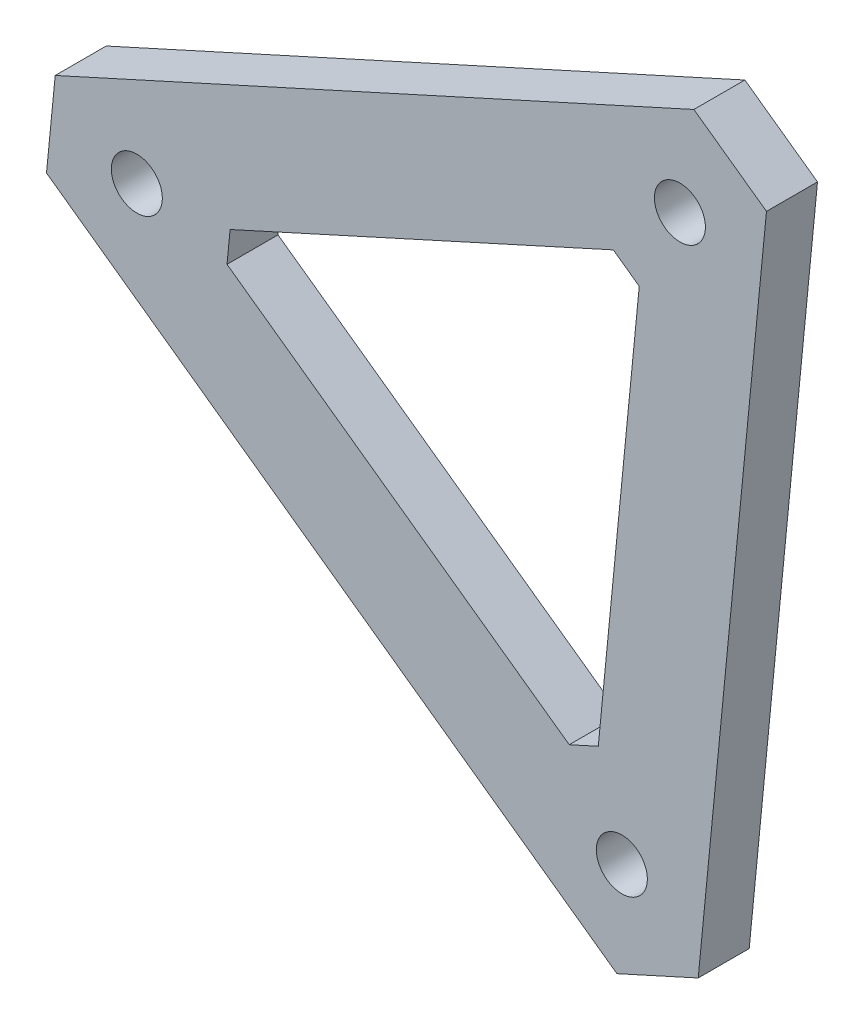
ISO-10303-21;
HEADER;
FILE_DESCRIPTION(('STEP AP214'),'2;1');
FILE_NAME('part.step','',(''),(''),'','','');
FILE_SCHEMA(('AUTOMOTIVE_DESIGN { 1 0 10303 214 1 1 1 1 }'));
ENDSEC;
DATA;
#1=APPLICATION_CONTEXT('core data for automotive mechanical design processes');
#2=APPLICATION_PROTOCOL_DEFINITION('international standard','automotive_design',2000,#1);
#3=PRODUCT_CONTEXT('',#1,'mechanical');
#4=PRODUCT('Part','Part','',(#3));
#5=PRODUCT_RELATED_PRODUCT_CATEGORY('part','',(#4));
#6=PRODUCT_DEFINITION_FORMATION('','',#4);
#7=PRODUCT_DEFINITION_CONTEXT('part definition',#1,'design');
#8=PRODUCT_DEFINITION('design','',#6,#7);
#9=PRODUCT_DEFINITION_SHAPE('','',#8);
#10=(LENGTH_UNIT() NAMED_UNIT(*) SI_UNIT(.MILLI.,.METRE.));
#11=(NAMED_UNIT(*) PLANE_ANGLE_UNIT() SI_UNIT($,.RADIAN.));
#12=(NAMED_UNIT(*) SI_UNIT($,.STERADIAN.) SOLID_ANGLE_UNIT());
#13=UNCERTAINTY_MEASURE_WITH_UNIT(LENGTH_MEASURE(1.E-05),#10,'distance_accuracy_value','');
#14=(GEOMETRIC_REPRESENTATION_CONTEXT(3) GLOBAL_UNCERTAINTY_ASSIGNED_CONTEXT((#13)) GLOBAL_UNIT_ASSIGNED_CONTEXT((#10,
#11,#12)) REPRESENTATION_CONTEXT('',''));
#15=CARTESIAN_POINT('',(0.,0.,0.));
#16=DIRECTION('',(0.,0.,1.));
#17=DIRECTION('',(1.,0.,0.));
#18=AXIS2_PLACEMENT_3D('',#15,#16,#17);
#19=CARTESIAN_POINT('',(277.371059914553,170.655756993951,-25.4));
#20=DIRECTION('',(0.581941296119595,0.813230796189277,0.));
#21=DIRECTION('',(-0.813230796189277,0.581941296119595,0.));
#22=AXIS2_PLACEMENT_3D('',#19,#20,#21);
#23=PLANE('',#22);
#24=DIRECTION('',(-0.813230796189277,0.581941296119595,0.));
#25=VECTOR('',#24,1.);
#26=CARTESIAN_POINT('',(277.371059914553,170.655756993951,0.));
#27=LINE('',#26,#25);
#28=CARTESIAN_POINT('',(313.519168805166,144.788466381435,0.));
#29=VERTEX_POINT('',#28);
#30=CARTESIAN_POINT('',(277.371059914553,170.655756993951,0.));
#31=VERTEX_POINT('',#30);
#32=EDGE_CURVE('E184',#29,#31,#27,.T.);
#33=ORIENTED_EDGE('',*,*,#32,.F.);
#34=DIRECTION('',(0.,0.,1.));
#35=VECTOR('',#34,1.);
#36=CARTESIAN_POINT('',(313.519168805166,144.788466381435,-25.4));
#37=LINE('',#36,#35);
#38=CARTESIAN_POINT('',(313.519168805166,144.788466381435,-25.4));
#39=VERTEX_POINT('',#38);
#40=EDGE_CURVE('E11',#39,#29,#37,.T.);
#41=ORIENTED_EDGE('',*,*,#40,.F.);
#42=DIRECTION('',(-0.813230796189277,0.581941296119595,0.));
#43=VECTOR('',#42,1.);
#44=CARTESIAN_POINT('',(277.371059914553,170.655756993951,-25.4));
#45=LINE('',#44,#43);
#46=CARTESIAN_POINT('',(277.371059914553,170.655756993951,-25.4));
#47=VERTEX_POINT('',#46);
#48=EDGE_CURVE('E202',#39,#47,#45,.T.);
#49=ORIENTED_EDGE('',*,*,#48,.T.);
#50=DIRECTION('',(0.,0.,1.));
#51=VECTOR('',#50,1.);
#52=CARTESIAN_POINT('',(277.371059914553,170.655756993951,-25.4));
#53=LINE('',#52,#51);
#54=EDGE_CURVE('E33',#47,#31,#53,.T.);
#55=ORIENTED_EDGE('',*,*,#54,.T.);
#56=EDGE_LOOP('',(#33,#41,#49,#55));
#57=FACE_BOUND('',#56,.T.);
#58=ADVANCED_FACE('F30',(#57),#23,.T.);
#59=CARTESIAN_POINT('',(279.515997466396,-202.802308580885,-25.4));
#60=DIRECTION('',(0.995249176699556,-0.0973605478561793,0.));
#61=DIRECTION('',(0.0973605478561793,0.995249176699556,0.));
#62=AXIS2_PLACEMENT_3D('',#59,#60,#61);
#63=PLANE('',#62);
#64=DIRECTION('',(0.0973605478561793,0.995249176699556,0.));
#65=VECTOR('',#64,1.);
#66=CARTESIAN_POINT('',(279.515997466396,-202.802308580885,0.));
#67=LINE('',#66,#65);
#68=CARTESIAN_POINT('',(279.515997466396,-202.802308580885,0.));
#69=VERTEX_POINT('',#68);
#70=EDGE_CURVE('E199',#69,#29,#67,.T.);
#71=ORIENTED_EDGE('',*,*,#70,.F.);
#72=DIRECTION('',(0.,0.,1.));
#73=VECTOR('',#72,1.);
#74=CARTESIAN_POINT('',(279.515997466396,-202.802308580885,-25.4));
#75=LINE('',#74,#73);
#76=CARTESIAN_POINT('',(279.515997466396,-202.802308580885,-25.4));
#77=VERTEX_POINT('',#76);
#78=EDGE_CURVE('E38',#77,#69,#75,.T.);
#79=ORIENTED_EDGE('',*,*,#78,.F.);
#80=DIRECTION('',(0.0973605478561793,0.995249176699556,0.));
#81=VECTOR('',#80,1.);
#82=CARTESIAN_POINT('',(279.515997466396,-202.802308580885,-25.4));
#83=LINE('',#82,#81);
#84=EDGE_CURVE('E217',#77,#39,#83,.T.);
#85=ORIENTED_EDGE('',*,*,#84,.T.);
#86=ORIENTED_EDGE('',*,*,#40,.T.);
#87=EDGE_LOOP('',(#71,#79,#85,#86));
#88=FACE_BOUND('',#87,.T.);
#89=ADVANCED_FACE('F237',(#88),#63,.T.);
#90=CARTESIAN_POINT('',(239.040212223575,-221.173843872663,-25.4));
#91=DIRECTION('',(0.413307880579936,-0.910591344045462,0.));
#92=DIRECTION('',(0.910591344045462,0.413307880579936,0.));
#93=AXIS2_PLACEMENT_3D('',#90,#91,#92);
#94=PLANE('',#93);
#95=DIRECTION('',(0.910591344045462,0.413307880579936,0.));
#96=VECTOR('',#95,1.);
#97=CARTESIAN_POINT('',(239.040212223575,-221.173843872663,0.));
#98=LINE('',#97,#96);
#99=CARTESIAN_POINT('',(239.040212223575,-221.173843872663,0.));
#100=VERTEX_POINT('',#99);
#101=EDGE_CURVE('E196',#100,#69,#98,.T.);
#102=ORIENTED_EDGE('',*,*,#101,.F.);
#103=DIRECTION('',(0.,0.,1.));
#104=VECTOR('',#103,1.);
#105=CARTESIAN_POINT('',(239.040212223575,-221.173843872663,-25.4));
#106=LINE('',#105,#104);
#107=CARTESIAN_POINT('',(239.040212223575,-221.173843872663,-25.4));
#108=VERTEX_POINT('',#107);
#109=EDGE_CURVE('E221',#108,#100,#106,.T.);
#110=ORIENTED_EDGE('',*,*,#109,.F.);
#111=DIRECTION('',(0.910591344045462,0.413307880579936,0.));
#112=VECTOR('',#111,1.);
#113=CARTESIAN_POINT('',(239.040212223575,-221.173843872663,-25.4));
#114=LINE('',#113,#112);
#115=EDGE_CURVE('E214',#108,#77,#114,.T.);
#116=ORIENTED_EDGE('',*,*,#115,.T.);
#117=ORIENTED_EDGE('',*,*,#78,.T.);
#118=EDGE_LOOP('',(#102,#110,#116,#117));
#119=FACE_BOUND('',#118,.T.);
#120=ADVANCED_FACE('F250',(#119),#94,.T.);
#121=CARTESIAN_POINT('',(-44.9806433455296,-17.9308462028934,-25.4));
#122=DIRECTION('',(-0.581941296119598,-0.813230796189275,0.));
#123=DIRECTION('',(0.813230796189276,-0.581941296119598,0.));
#124=AXIS2_PLACEMENT_3D('',#121,#122,#123);
#125=PLANE('',#124);
#126=DIRECTION('',(0.813230796189275,-0.581941296119598,0.));
#127=VECTOR('',#126,1.);
#128=CARTESIAN_POINT('',(-44.9806433455296,-17.9308462028934,0.));
#129=LINE('',#128,#127);
#130=CARTESIAN_POINT('',(-44.9806433455296,-17.9308462028934,0.));
#131=VERTEX_POINT('',#130);
#132=EDGE_CURVE('E193',#131,#100,#129,.T.);
#133=ORIENTED_EDGE('',*,*,#132,.F.);
#134=DIRECTION('',(0.,0.,1.));
#135=VECTOR('',#134,1.);
#136=CARTESIAN_POINT('',(-44.9806433455296,-17.9308462028934,-25.4));
#137=LINE('',#136,#135);
#138=CARTESIAN_POINT('',(-44.9806433455296,-17.9308462028934,-25.4));
#139=VERTEX_POINT('',#138);
#140=EDGE_CURVE('E223',#139,#131,#137,.T.);
#141=ORIENTED_EDGE('',*,*,#140,.F.);
#142=DIRECTION('',(0.813230796189275,-0.581941296119598,0.));
#143=VECTOR('',#142,1.);
#144=CARTESIAN_POINT('',(-44.9806433455296,-17.9308462028934,-25.4));
#145=LINE('',#144,#143);
#146=EDGE_CURVE('E211',#139,#108,#145,.T.);
#147=ORIENTED_EDGE('',*,*,#146,.T.);
#148=ORIENTED_EDGE('',*,*,#109,.T.);
#149=EDGE_LOOP('',(#133,#141,#147,#148));
#150=FACE_BOUND('',#149,.T.);
#151=ADVANCED_FACE('F248',(#150),#125,.T.);
#152=CARTESIAN_POINT('',(-40.6529669933218,26.3079797014018,-25.4));
#153=DIRECTION('',(-0.995249176699555,0.0973605478561946,0.));
#154=DIRECTION('',(-0.0973605478561946,-0.995249176699555,0.));
#155=AXIS2_PLACEMENT_3D('',#152,#153,#154);
#156=PLANE('',#155);
#157=DIRECTION('',(-0.0973605478561946,-0.995249176699555,0.));
#158=VECTOR('',#157,1.);
#159=CARTESIAN_POINT('',(-40.6529669933218,26.3079797014018,0.));
#160=LINE('',#159,#158);
#161=CARTESIAN_POINT('',(-40.6529669933218,26.3079797014018,0.));
#162=VERTEX_POINT('',#161);
#163=EDGE_CURVE('E190',#162,#131,#160,.T.);
#164=ORIENTED_EDGE('',*,*,#163,.F.);
#165=DIRECTION('',(0.,0.,1.));
#166=VECTOR('',#165,1.);
#167=CARTESIAN_POINT('',(-40.6529669933218,26.3079797014018,-25.4));
#168=LINE('',#167,#166);
#169=CARTESIAN_POINT('',(-40.6529669933218,26.3079797014018,-25.4));
#170=VERTEX_POINT('',#169);
#171=EDGE_CURVE('E224',#170,#162,#168,.T.);
#172=ORIENTED_EDGE('',*,*,#171,.F.);
#173=DIRECTION('',(-0.0973605478561946,-0.995249176699555,0.));
#174=VECTOR('',#173,1.);
#175=CARTESIAN_POINT('',(-40.6529669933218,26.3079797014018,-25.4));
#176=LINE('',#175,#174);
#177=EDGE_CURVE('E208',#170,#139,#176,.T.);
#178=ORIENTED_EDGE('',*,*,#177,.T.);
#179=ORIENTED_EDGE('',*,*,#140,.T.);
#180=EDGE_LOOP('',(#164,#172,#178,#179));
#181=FACE_BOUND('',#180,.T.);
#182=ADVANCED_FACE('F245',(#181),#156,.T.);
#183=CARTESIAN_POINT('',(277.371059914553,170.655756993951,-25.4));
#184=DIRECTION('',(-0.413307880579956,0.910591344045453,0.));
#185=DIRECTION('',(-0.910591344045453,-0.413307880579955,0.));
#186=AXIS2_PLACEMENT_3D('',#183,#184,#185);
#187=PLANE('',#186);
#188=DIRECTION('',(-0.910591344045453,-0.413307880579956,0.));
#189=VECTOR('',#188,1.);
#190=CARTESIAN_POINT('',(277.371059914553,170.655756993951,0.));
#191=LINE('',#190,#189);
#192=EDGE_CURVE('E187',#31,#162,#191,.T.);
#193=ORIENTED_EDGE('',*,*,#192,.F.);
#194=ORIENTED_EDGE('',*,*,#54,.F.);
#195=DIRECTION('',(-0.910591344045453,-0.413307880579956,0.));
#196=VECTOR('',#195,1.);
#197=CARTESIAN_POINT('',(277.371059914553,170.655756993951,-25.4));
#198=LINE('',#197,#196);
#199=EDGE_CURVE('E205',#47,#170,#198,.T.);
#200=ORIENTED_EDGE('',*,*,#199,.T.);
#201=ORIENTED_EDGE('',*,*,#171,.T.);
#202=EDGE_LOOP('',(#193,#194,#200,#201));
#203=FACE_BOUND('',#202,.T.);
#204=ADVANCED_FACE('F232',(#203),#187,.T.);
#205=CARTESIAN_POINT('',(-6.64979565454638,373.898754663716,-25.4));
#206=DIRECTION('',(0.,0.,-1.));
#207=DIRECTION('',(-1.,0.,0.));
#208=AXIS2_PLACEMENT_3D('',#205,#206,#207);
#209=PLANE('',#208);
#210=CARTESIAN_POINT('',(241.497107470573,-172.813351866535,-25.4));
#211=DIRECTION('',(0.,0.,1.));
#212=DIRECTION('',(1.,0.,0.));
#213=AXIS2_PLACEMENT_3D('',#210,#211,#212);
#214=CIRCLE('',#213,12.7);
#215=CARTESIAN_POINT('',(254.197107470573,-172.813351866535,-25.4));
#216=VERTEX_POINT('',#215);
#217=EDGE_CURVE('E401',#216,#216,#214,.T.);
#218=ORIENTED_EDGE('',*,*,#217,.T.);
#219=EDGE_LOOP('',(#218));
#220=FACE_BOUND('',#219,.T.);
#221=DIRECTION('',(-0.813230796189274,0.5819412961196,0.));
#222=VECTOR('',#221,1.);
#223=CARTESIAN_POINT('',(250.162803153211,80.8028926971345,-25.4));
#224=LINE('',#223,#222);
#225=CARTESIAN_POINT('',(250.162803153211,80.8028926971345,-25.4));
#226=VERTEX_POINT('',#225);
#227=CARTESIAN_POINT('',(237.252764263706,90.0412107730331,-25.4));
#228=VERTEX_POINT('',#227);
#229=EDGE_CURVE('E149',#226,#228,#224,.T.);
#230=ORIENTED_EDGE('',*,*,#229,.T.);
#231=DIRECTION('',(-0.910591344045453,-0.413307880579956,0.));
#232=VECTOR('',#231,1.);
#233=CARTESIAN_POINT('',(237.252764263706,90.0412107730331,-25.4));
#234=LINE('',#233,#232);
#235=CARTESIAN_POINT('',(46.4383481189815,3.43254439750325,-25.4));
#236=VERTEX_POINT('',#235);
#237=EDGE_CURVE('E152',#228,#236,#234,.T.);
#238=ORIENTED_EDGE('',*,*,#237,.T.);
#239=DIRECTION('',(-0.0973605478561787,-0.995249176699556,0.));
#240=VECTOR('',#239,1.);
#241=CARTESIAN_POINT('',(46.4383481189815,3.43254439750328,-25.4));
#242=LINE('',#241,#240);
#243=CARTESIAN_POINT('',(44.8927494217646,-12.3670362826022,-25.4));
#244=VERTEX_POINT('',#243);
#245=EDGE_CURVE('E46',#236,#244,#242,.T.);
#246=ORIENTED_EDGE('',*,*,#245,.T.);
#247=DIRECTION('',(0.813230796189274,-0.5819412961196,0.));
#248=VECTOR('',#247,1.);
#249=CARTESIAN_POINT('',(44.8927494217646,-12.3670362826022,-25.4));
#250=LINE('',#249,#248);
#251=CARTESIAN_POINT('',(215.305262763227,-134.312834884464,-25.4));
#252=VERTEX_POINT('',#251);
#253=EDGE_CURVE('E155',#244,#252,#250,.T.);
#254=ORIENTED_EDGE('',*,*,#253,.T.);
#255=DIRECTION('',(0.910591344045454,0.413307880579955,0.));
#256=VECTOR('',#255,1.);
#257=CARTESIAN_POINT('',(215.305262763227,-134.312834884464,-25.4));
#258=LINE('',#257,#256);
#259=CARTESIAN_POINT('',(229.760900349949,-127.751572280258,-25.4));
#260=VERTEX_POINT('',#259);
#261=EDGE_CURVE('E158',#252,#260,#258,.T.);
#262=ORIENTED_EDGE('',*,*,#261,.T.);
#263=DIRECTION('',(0.0973605478561792,0.995249176699556,0.));
#264=VECTOR('',#263,1.);
#265=CARTESIAN_POINT('',(229.760900349949,-127.751572280258,-25.4));
#266=LINE('',#265,#264);
#267=EDGE_CURVE('E161',#260,#226,#266,.T.);
#268=ORIENTED_EDGE('',*,*,#267,.T.);
#269=EDGE_LOOP('',(#230,#238,#246,#254,#262,#268));
#270=FACE_BOUND('',#269,.T.);
#271=CARTESIAN_POINT('',(270.409306564845,122.735954076708,-25.4));
#272=DIRECTION('',(0.,0.,1.));
#273=DIRECTION('',(1.,0.,0.));
#274=AXIS2_PLACEMENT_3D('',#271,#272,#273);
#275=CIRCLE('',#274,12.7);
#276=CARTESIAN_POINT('',(283.109306564845,122.735954076708,-25.4));
#277=VERTEX_POINT('',#276);
#278=EDGE_CURVE('E175',#277,#277,#275,.T.);
#279=ORIENTED_EDGE('',*,*,#278,.T.);
#280=EDGE_LOOP('',(#279));
#281=FACE_BOUND('',#280,.T.);
#282=CARTESIAN_POINT('',(1.66533453693773E-13,-2.04697370165263E-13,-25.4));
#283=DIRECTION('',(0.,0.,1.));
#284=DIRECTION('',(1.,0.,0.));
#285=AXIS2_PLACEMENT_3D('',#282,#283,#284);
#286=CIRCLE('',#285,12.7);
#287=CARTESIAN_POINT('',(12.7000000000002,-2.04697370165263E-13,-25.4));
#288=VERTEX_POINT('',#287);
#289=EDGE_CURVE('E181',#288,#288,#286,.T.);
#290=ORIENTED_EDGE('',*,*,#289,.T.);
#291=EDGE_LOOP('',(#290));
#292=FACE_BOUND('',#291,.T.);
#293=ORIENTED_EDGE('',*,*,#48,.F.);
#294=ORIENTED_EDGE('',*,*,#84,.F.);
#295=ORIENTED_EDGE('',*,*,#115,.F.);
#296=ORIENTED_EDGE('',*,*,#146,.F.);
#297=ORIENTED_EDGE('',*,*,#177,.F.);
#298=ORIENTED_EDGE('',*,*,#199,.F.);
#299=EDGE_LOOP('',(#293,#294,#295,#296,#297,#298));
#300=FACE_BOUND('',#299,.T.);
#301=ADVANCED_FACE('F240',(#220,#270,#281,#292,#300),#209,.T.);
#302=CARTESIAN_POINT('',(-6.64979565454638,373.898754663716,0.));
#303=DIRECTION('',(0.,0.,-1.));
#304=DIRECTION('',(-1.,0.,0.));
#305=AXIS2_PLACEMENT_3D('',#302,#303,#304);
#306=PLANE('',#305);
#307=CARTESIAN_POINT('',(241.497107470573,-172.813351866535,0.));
#308=DIRECTION('',(0.,0.,1.));
#309=DIRECTION('',(1.,0.,0.));
#310=AXIS2_PLACEMENT_3D('',#307,#308,#309);
#311=CIRCLE('',#310,12.7);
#312=CARTESIAN_POINT('',(254.197107470573,-172.813351866535,0.));
#313=VERTEX_POINT('',#312);
#314=EDGE_CURVE('E404',#313,#313,#311,.T.);
#315=ORIENTED_EDGE('',*,*,#314,.F.);
#316=EDGE_LOOP('',(#315));
#317=FACE_BOUND('',#316,.T.);
#318=DIRECTION('',(-0.910591344045453,-0.413307880579956,0.));
#319=VECTOR('',#318,1.);
#320=CARTESIAN_POINT('',(237.252764263706,90.0412107730331,0.));
#321=LINE('',#320,#319);
#322=CARTESIAN_POINT('',(237.252764263706,90.0412107730331,0.));
#323=VERTEX_POINT('',#322);
#324=CARTESIAN_POINT('',(46.4383481189815,3.43254439750328,0.));
#325=VERTEX_POINT('',#324);
#326=EDGE_CURVE('E130',#323,#325,#321,.T.);
#327=ORIENTED_EDGE('',*,*,#326,.F.);
#328=DIRECTION('',(-0.813230796189274,0.5819412961196,0.));
#329=VECTOR('',#328,1.);
#330=CARTESIAN_POINT('',(250.162803153211,80.8028926971345,0.));
#331=LINE('',#330,#329);
#332=CARTESIAN_POINT('',(250.162803153211,80.8028926971345,0.));
#333=VERTEX_POINT('',#332);
#334=EDGE_CURVE('E54',#333,#323,#331,.T.);
#335=ORIENTED_EDGE('',*,*,#334,.F.);
#336=DIRECTION('',(0.0973605478561792,0.995249176699556,0.));
#337=VECTOR('',#336,1.);
#338=CARTESIAN_POINT('',(229.760900349949,-127.751572280258,0.));
#339=LINE('',#338,#337);
#340=CARTESIAN_POINT('',(229.760900349949,-127.751572280258,0.));
#341=VERTEX_POINT('',#340);
#342=EDGE_CURVE('E146',#341,#333,#339,.T.);
#343=ORIENTED_EDGE('',*,*,#342,.F.);
#344=DIRECTION('',(0.910591344045454,0.413307880579955,0.));
#345=VECTOR('',#344,1.);
#346=CARTESIAN_POINT('',(215.305262763227,-134.312834884464,0.));
#347=LINE('',#346,#345);
#348=CARTESIAN_POINT('',(215.305262763227,-134.312834884464,0.));
#349=VERTEX_POINT('',#348);
#350=EDGE_CURVE('E140',#349,#341,#347,.T.);
#351=ORIENTED_EDGE('',*,*,#350,.F.);
#352=DIRECTION('',(0.813230796189274,-0.5819412961196,0.));
#353=VECTOR('',#352,1.);
#354=CARTESIAN_POINT('',(44.8927494217646,-12.3670362826022,0.));
#355=LINE('',#354,#353);
#356=CARTESIAN_POINT('',(44.8927494217646,-12.3670362826022,0.));
#357=VERTEX_POINT('',#356);
#358=EDGE_CURVE('E138',#357,#349,#355,.T.);
#359=ORIENTED_EDGE('',*,*,#358,.F.);
#360=DIRECTION('',(-0.0973605478561787,-0.995249176699556,0.));
#361=VECTOR('',#360,1.);
#362=CARTESIAN_POINT('',(46.4383481189815,3.43254439750328,0.));
#363=LINE('',#362,#361);
#364=EDGE_CURVE('E121',#325,#357,#363,.T.);
#365=ORIENTED_EDGE('',*,*,#364,.F.);
#366=EDGE_LOOP('',(#327,#335,#343,#351,#359,#365));
#367=FACE_BOUND('',#366,.T.);
#368=CARTESIAN_POINT('',(270.409306564845,122.735954076708,0.));
#369=DIRECTION('',(0.,0.,1.));
#370=DIRECTION('',(1.,0.,0.));
#371=AXIS2_PLACEMENT_3D('',#368,#369,#370);
#372=CIRCLE('',#371,12.7);
#373=CARTESIAN_POINT('',(283.109306564845,122.735954076708,0.));
#374=VERTEX_POINT('',#373);
#375=EDGE_CURVE('E166',#374,#374,#372,.T.);
#376=ORIENTED_EDGE('',*,*,#375,.F.);
#377=EDGE_LOOP('',(#376));
#378=FACE_BOUND('',#377,.T.);
#379=CARTESIAN_POINT('',(1.66533453693773E-13,-2.04697370165263E-13,0.));
#380=DIRECTION('',(0.,0.,1.));
#381=DIRECTION('',(1.,0.,0.));
#382=AXIS2_PLACEMENT_3D('',#379,#380,#381);
#383=CIRCLE('',#382,12.7);
#384=CARTESIAN_POINT('',(12.7000000000002,-2.04697370165263E-13,0.));
#385=VERTEX_POINT('',#384);
#386=EDGE_CURVE('E178',#385,#385,#383,.T.);
#387=ORIENTED_EDGE('',*,*,#386,.F.);
#388=EDGE_LOOP('',(#387));
#389=FACE_BOUND('',#388,.T.);
#390=ORIENTED_EDGE('',*,*,#32,.T.);
#391=ORIENTED_EDGE('',*,*,#192,.T.);
#392=ORIENTED_EDGE('',*,*,#163,.T.);
#393=ORIENTED_EDGE('',*,*,#132,.T.);
#394=ORIENTED_EDGE('',*,*,#101,.T.);
#395=ORIENTED_EDGE('',*,*,#70,.T.);
#396=EDGE_LOOP('',(#390,#391,#392,#393,#394,#395));
#397=FACE_BOUND('',#396,.T.);
#398=ADVANCED_FACE('F134',(#317,#367,#378,#389,#397),#306,.F.);
#399=CARTESIAN_POINT('',(1.66533453693773E-13,-2.04697370165263E-13,-25.4));
#400=DIRECTION('',(0.,0.,1.));
#401=DIRECTION('',(1.,0.,0.));
#402=AXIS2_PLACEMENT_3D('',#399,#400,#401);
#403=CYLINDRICAL_SURFACE('',#402,12.7);
#404=ORIENTED_EDGE('',*,*,#289,.F.);
#405=EDGE_LOOP('',(#404));
#406=FACE_BOUND('',#405,.T.);
#407=ORIENTED_EDGE('',*,*,#386,.T.);
#408=EDGE_LOOP('',(#407));
#409=FACE_BOUND('',#408,.T.);
#410=ADVANCED_FACE('F309',(#406,#409),#403,.F.);
#411=CARTESIAN_POINT('',(270.409306564845,122.735954076708,-25.4));
#412=DIRECTION('',(0.,0.,1.));
#413=DIRECTION('',(1.,0.,0.));
#414=AXIS2_PLACEMENT_3D('',#411,#412,#413);
#415=CYLINDRICAL_SURFACE('',#414,12.7);
#416=ORIENTED_EDGE('',*,*,#278,.F.);
#417=EDGE_LOOP('',(#416));
#418=FACE_BOUND('',#417,.T.);
#419=ORIENTED_EDGE('',*,*,#375,.T.);
#420=EDGE_LOOP('',(#419));
#421=FACE_BOUND('',#420,.T.);
#422=ADVANCED_FACE('F319',(#418,#421),#415,.F.);
#423=CARTESIAN_POINT('',(250.162803153211,80.8028926971345,-25.4));
#424=DIRECTION('',(0.5819412961196,0.813230796189274,0.));
#425=DIRECTION('',(-0.813230796189274,0.5819412961196,0.));
#426=AXIS2_PLACEMENT_3D('',#423,#424,#425);
#427=PLANE('',#426);
#428=ORIENTED_EDGE('',*,*,#334,.T.);
#429=DIRECTION('',(0.,0.,1.));
#430=VECTOR('',#429,1.);
#431=CARTESIAN_POINT('',(237.252764263706,90.0412107730331,-25.4));
#432=LINE('',#431,#430);
#433=EDGE_CURVE('E127',#228,#323,#432,.T.);
#434=ORIENTED_EDGE('',*,*,#433,.F.);
#435=ORIENTED_EDGE('',*,*,#229,.F.);
#436=DIRECTION('',(0.,0.,1.));
#437=VECTOR('',#436,1.);
#438=CARTESIAN_POINT('',(250.162803153211,80.8028926971345,-25.4));
#439=LINE('',#438,#437);
#440=EDGE_CURVE('E164',#226,#333,#439,.T.);
#441=ORIENTED_EDGE('',*,*,#440,.T.);
#442=EDGE_LOOP('',(#428,#434,#435,#441));
#443=FACE_BOUND('',#442,.T.);
#444=ADVANCED_FACE('F329',(#443),#427,.F.);
#445=CARTESIAN_POINT('',(229.760900349949,-127.751572280258,-25.4));
#446=DIRECTION('',(0.995249176699556,-0.0973605478561792,0.));
#447=DIRECTION('',(0.0973605478561792,0.995249176699556,0.));
#448=AXIS2_PLACEMENT_3D('',#445,#446,#447);
#449=PLANE('',#448);
#450=ORIENTED_EDGE('',*,*,#342,.T.);
#451=ORIENTED_EDGE('',*,*,#440,.F.);
#452=ORIENTED_EDGE('',*,*,#267,.F.);
#453=DIRECTION('',(0.,0.,1.));
#454=VECTOR('',#453,1.);
#455=CARTESIAN_POINT('',(229.760900349949,-127.751572280258,-25.4));
#456=LINE('',#455,#454);
#457=EDGE_CURVE('E167',#260,#341,#456,.T.);
#458=ORIENTED_EDGE('',*,*,#457,.T.);
#459=EDGE_LOOP('',(#450,#451,#452,#458));
#460=FACE_BOUND('',#459,.T.);
#461=ADVANCED_FACE('F339',(#460),#449,.F.);
#462=CARTESIAN_POINT('',(215.305262763227,-134.312834884464,-25.4));
#463=DIRECTION('',(0.413307880579955,-0.910591344045454,0.));
#464=DIRECTION('',(0.910591344045454,0.413307880579955,0.));
#465=AXIS2_PLACEMENT_3D('',#462,#463,#464);
#466=PLANE('',#465);
#467=ORIENTED_EDGE('',*,*,#350,.T.);
#468=ORIENTED_EDGE('',*,*,#457,.F.);
#469=ORIENTED_EDGE('',*,*,#261,.F.);
#470=DIRECTION('',(0.,0.,1.));
#471=VECTOR('',#470,1.);
#472=CARTESIAN_POINT('',(215.305262763227,-134.312834884464,-25.4));
#473=LINE('',#472,#471);
#474=EDGE_CURVE('E169',#252,#349,#473,.T.);
#475=ORIENTED_EDGE('',*,*,#474,.T.);
#476=EDGE_LOOP('',(#467,#468,#469,#475));
#477=FACE_BOUND('',#476,.T.);
#478=ADVANCED_FACE('F348',(#477),#466,.F.);
#479=CARTESIAN_POINT('',(44.8927494217646,-12.3670362826022,-25.4));
#480=DIRECTION('',(-0.5819412961196,-0.813230796189274,0.));
#481=DIRECTION('',(0.813230796189274,-0.5819412961196,0.));
#482=AXIS2_PLACEMENT_3D('',#479,#480,#481);
#483=PLANE('',#482);
#484=ORIENTED_EDGE('',*,*,#358,.T.);
#485=ORIENTED_EDGE('',*,*,#474,.F.);
#486=ORIENTED_EDGE('',*,*,#253,.F.);
#487=DIRECTION('',(0.,0.,1.));
#488=VECTOR('',#487,1.);
#489=CARTESIAN_POINT('',(44.8927494217646,-12.3670362826022,-25.4));
#490=LINE('',#489,#488);
#491=EDGE_CURVE('E126',#244,#357,#490,.T.);
#492=ORIENTED_EDGE('',*,*,#491,.T.);
#493=EDGE_LOOP('',(#484,#485,#486,#492));
#494=FACE_BOUND('',#493,.T.);
#495=ADVANCED_FACE('F358',(#494),#483,.F.);
#496=CARTESIAN_POINT('',(46.4383481189815,3.43254439750328,-25.4));
#497=DIRECTION('',(-0.995249176699556,0.0973605478561787,0.));
#498=DIRECTION('',(-0.0973605478561787,-0.995249176699556,0.));
#499=AXIS2_PLACEMENT_3D('',#496,#497,#498);
#500=PLANE('',#499);
#501=ORIENTED_EDGE('',*,*,#364,.T.);
#502=ORIENTED_EDGE('',*,*,#491,.F.);
#503=ORIENTED_EDGE('',*,*,#245,.F.);
#504=DIRECTION('',(0.,0.,1.));
#505=VECTOR('',#504,1.);
#506=CARTESIAN_POINT('',(46.4383481189815,3.43254439750328,-25.4));
#507=LINE('',#506,#505);
#508=EDGE_CURVE('E117',#236,#325,#507,.T.);
#509=ORIENTED_EDGE('',*,*,#508,.T.);
#510=EDGE_LOOP('',(#501,#502,#503,#509));
#511=FACE_BOUND('',#510,.T.);
#512=ADVANCED_FACE('F119',(#511),#500,.F.);
#513=CARTESIAN_POINT('',(237.252764263706,90.0412107730331,-25.4));
#514=DIRECTION('',(-0.413307880579956,0.910591344045453,0.));
#515=DIRECTION('',(-0.910591344045453,-0.413307880579956,0.));
#516=AXIS2_PLACEMENT_3D('',#513,#514,#515);
#517=PLANE('',#516);
#518=ORIENTED_EDGE('',*,*,#326,.T.);
#519=ORIENTED_EDGE('',*,*,#508,.F.);
#520=ORIENTED_EDGE('',*,*,#237,.F.);
#521=ORIENTED_EDGE('',*,*,#433,.T.);
#522=EDGE_LOOP('',(#518,#519,#520,#521));
#523=FACE_BOUND('',#522,.T.);
#524=ADVANCED_FACE('F131',(#523),#517,.F.);
#525=CARTESIAN_POINT('',(241.497107470573,-172.813351866535,-25.4));
#526=DIRECTION('',(0.,0.,1.));
#527=DIRECTION('',(1.,0.,0.));
#528=AXIS2_PLACEMENT_3D('',#525,#526,#527);
#529=CYLINDRICAL_SURFACE('',#528,12.7);
#530=ORIENTED_EDGE('',*,*,#217,.F.);
#531=EDGE_LOOP('',(#530));
#532=FACE_BOUND('',#531,.T.);
#533=ORIENTED_EDGE('',*,*,#314,.T.);
#534=EDGE_LOOP('',(#533));
#535=FACE_BOUND('',#534,.T.);
#536=ADVANCED_FACE('F385',(#532,#535),#529,.F.);
#537=CLOSED_SHELL('',(#58,#89,#120,#151,#182,#204,#301,#398,#410,#422,#444,#461,#478,#495,#512,
#524,#536));
#538=MANIFOLD_SOLID_BREP('B2',#537);
#539=ADVANCED_BREP_SHAPE_REPRESENTATION('',(#18,#538),#14);
#540=SHAPE_DEFINITION_REPRESENTATION(#9,#539);
ENDSEC;
END-ISO-10303-21;
